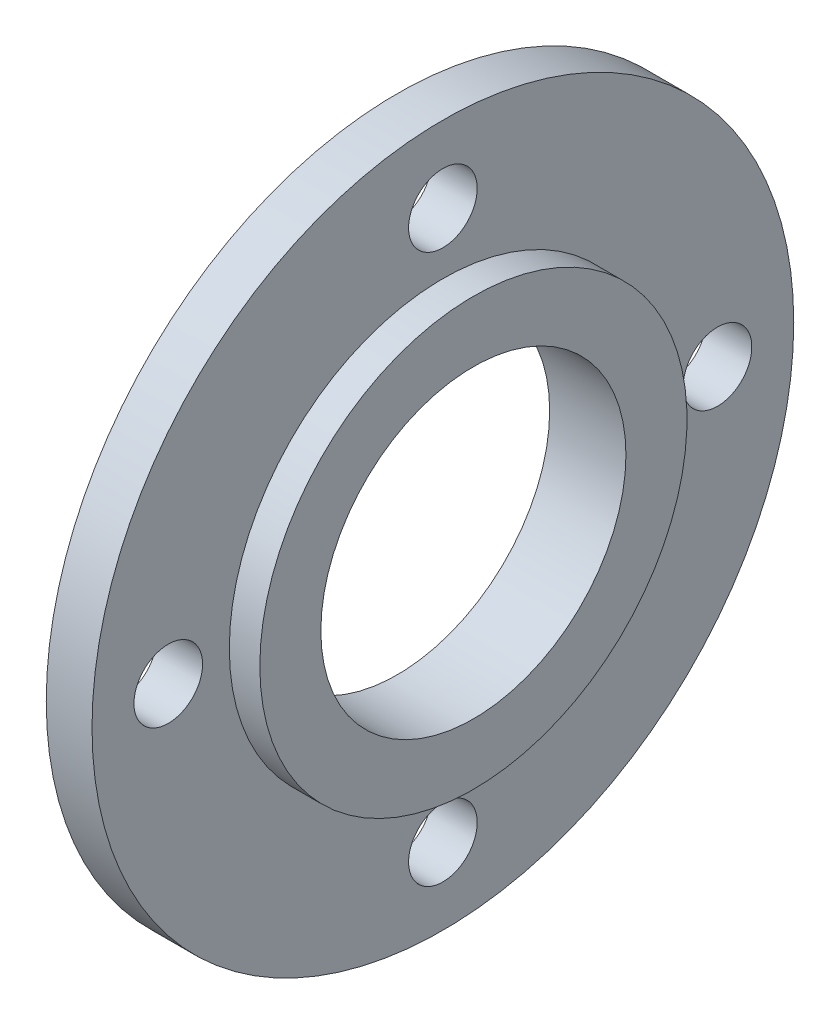
ISO-10303-21;
HEADER;
FILE_DESCRIPTION(('STEP AP214'),'2;1');
FILE_NAME('part.step','',(''),(''),'','','');
FILE_SCHEMA(('AUTOMOTIVE_DESIGN { 1 0 10303 214 1 1 1 1 }'));
ENDSEC;
DATA;
#1=APPLICATION_CONTEXT('core data for automotive mechanical design processes');
#2=APPLICATION_PROTOCOL_DEFINITION('international standard','automotive_design',2000,#1);
#3=PRODUCT_CONTEXT('',#1,'mechanical');
#4=PRODUCT('Part','Part','',(#3));
#5=PRODUCT_RELATED_PRODUCT_CATEGORY('part','',(#4));
#6=PRODUCT_DEFINITION_FORMATION('','',#4);
#7=PRODUCT_DEFINITION_CONTEXT('part definition',#1,'design');
#8=PRODUCT_DEFINITION('design','',#6,#7);
#9=PRODUCT_DEFINITION_SHAPE('','',#8);
#10=(LENGTH_UNIT() NAMED_UNIT(*) SI_UNIT(.MILLI.,.METRE.));
#11=(NAMED_UNIT(*) PLANE_ANGLE_UNIT() SI_UNIT($,.RADIAN.));
#12=(NAMED_UNIT(*) SI_UNIT($,.STERADIAN.) SOLID_ANGLE_UNIT());
#13=UNCERTAINTY_MEASURE_WITH_UNIT(LENGTH_MEASURE(1.E-05),#10,'distance_accuracy_value','');
#14=(GEOMETRIC_REPRESENTATION_CONTEXT(3) GLOBAL_UNCERTAINTY_ASSIGNED_CONTEXT((#13)) GLOBAL_UNIT_ASSIGNED_CONTEXT((#10,
#11,#12)) REPRESENTATION_CONTEXT('',''));
#15=CARTESIAN_POINT('',(0.,0.,0.));
#16=DIRECTION('',(0.,0.,1.));
#17=DIRECTION('',(1.,0.,0.));
#18=AXIS2_PLACEMENT_3D('',#15,#16,#17);
#19=CARTESIAN_POINT('',(0.,23.,0.));
#20=DIRECTION('',(1.,0.,0.));
#21=DIRECTION('',(0.,0.,-1.));
#22=AXIS2_PLACEMENT_3D('',#19,#20,#21);
#23=PLANE('',#22);
#24=CARTESIAN_POINT('',(0.,-18.,0.));
#25=DIRECTION('',(-1.,0.,0.));
#26=DIRECTION('',(0.,0.,1.));
#27=AXIS2_PLACEMENT_3D('',#24,#25,#26);
#28=CIRCLE('',#27,2.25);
#29=CARTESIAN_POINT('',(0.,-18.,2.25));
#30=VERTEX_POINT('',#29);
#31=EDGE_CURVE('E74',#30,#30,#28,.T.);
#32=ORIENTED_EDGE('',*,*,#31,.F.);
#33=EDGE_LOOP('',(#32));
#34=FACE_BOUND('',#33,.T.);
#35=CARTESIAN_POINT('',(0.,18.,0.));
#36=DIRECTION('',(-1.,0.,0.));
#37=DIRECTION('',(0.,0.,1.));
#38=AXIS2_PLACEMENT_3D('',#35,#36,#37);
#39=CIRCLE('',#38,2.25);
#40=CARTESIAN_POINT('',(0.,18.,2.25));
#41=VERTEX_POINT('',#40);
#42=EDGE_CURVE('E62',#41,#41,#39,.T.);
#43=ORIENTED_EDGE('',*,*,#42,.F.);
#44=EDGE_LOOP('',(#43));
#45=FACE_BOUND('',#44,.T.);
#46=CARTESIAN_POINT('',(0.,0.,0.));
#47=DIRECTION('',(-1.,0.,0.));
#48=DIRECTION('',(0.,0.,1.));
#49=AXIS2_PLACEMENT_3D('',#46,#47,#48);
#50=CIRCLE('',#49,10.);
#51=CARTESIAN_POINT('',(0.,0.,10.));
#52=VERTEX_POINT('',#51);
#53=EDGE_CURVE('E10',#52,#52,#50,.T.);
#54=ORIENTED_EDGE('',*,*,#53,.F.);
#55=EDGE_LOOP('',(#54));
#56=FACE_BOUND('',#55,.T.);
#57=CARTESIAN_POINT('',(0.,0.,0.));
#58=DIRECTION('',(-1.,0.,0.));
#59=DIRECTION('',(0.,0.,1.));
#60=AXIS2_PLACEMENT_3D('',#57,#58,#59);
#61=CIRCLE('',#60,23.);
#62=CARTESIAN_POINT('',(0.,0.,23.));
#63=VERTEX_POINT('',#62);
#64=EDGE_CURVE('E56',#63,#63,#61,.T.);
#65=ORIENTED_EDGE('',*,*,#64,.T.);
#66=EDGE_LOOP('',(#65));
#67=FACE_BOUND('',#66,.T.);
#68=CARTESIAN_POINT('',(0.,0.,-18.));
#69=DIRECTION('',(-1.,0.,0.));
#70=DIRECTION('',(0.,0.,1.));
#71=AXIS2_PLACEMENT_3D('',#68,#69,#70);
#72=CIRCLE('',#71,2.25);
#73=CARTESIAN_POINT('',(0.,0.,-15.75));
#74=VERTEX_POINT('',#73);
#75=EDGE_CURVE('E68',#74,#74,#72,.T.);
#76=ORIENTED_EDGE('',*,*,#75,.F.);
#77=EDGE_LOOP('',(#76));
#78=FACE_BOUND('',#77,.T.);
#79=CARTESIAN_POINT('',(0.,1.88539992297529E-13,18.));
#80=DIRECTION('',(-1.,0.,0.));
#81=DIRECTION('',(0.,0.,1.));
#82=AXIS2_PLACEMENT_3D('',#79,#80,#81);
#83=CIRCLE('',#82,2.25);
#84=CARTESIAN_POINT('',(0.,1.88539992297529E-13,20.25));
#85=VERTEX_POINT('',#84);
#86=EDGE_CURVE('E80',#85,#85,#83,.T.);
#87=ORIENTED_EDGE('',*,*,#86,.F.);
#88=EDGE_LOOP('',(#87));
#89=FACE_BOUND('',#88,.T.);
#90=ADVANCED_FACE('F34',(#34,#45,#56,#67,#78,#89),#23,.F.);
#91=CARTESIAN_POINT('',(0.,0.,0.));
#92=DIRECTION('',(-1.,0.,0.));
#93=DIRECTION('',(0.,0.,1.));
#94=AXIS2_PLACEMENT_3D('',#91,#92,#93);
#95=CYLINDRICAL_SURFACE('',#94,10.);
#96=CARTESIAN_POINT('',(5.,0.,0.));
#97=DIRECTION('',(-1.,0.,0.));
#98=DIRECTION('',(0.,0.,1.));
#99=AXIS2_PLACEMENT_3D('',#96,#97,#98);
#100=CIRCLE('',#99,10.);
#101=CARTESIAN_POINT('',(5.,0.,10.));
#102=VERTEX_POINT('',#101);
#103=EDGE_CURVE('E40',#102,#102,#100,.T.);
#104=ORIENTED_EDGE('',*,*,#103,.F.);
#105=EDGE_LOOP('',(#104));
#106=FACE_BOUND('',#105,.T.);
#107=ORIENTED_EDGE('',*,*,#53,.T.);
#108=EDGE_LOOP('',(#107));
#109=FACE_BOUND('',#108,.T.);
#110=ADVANCED_FACE('F87',(#106,#109),#95,.F.);
#111=CARTESIAN_POINT('',(5.,10.,0.));
#112=DIRECTION('',(-1.,0.,0.));
#113=DIRECTION('',(0.,0.,1.));
#114=AXIS2_PLACEMENT_3D('',#111,#112,#113);
#115=PLANE('',#114);
#116=CARTESIAN_POINT('',(5.,0.,0.));
#117=DIRECTION('',(-1.,0.,0.));
#118=DIRECTION('',(0.,0.,1.));
#119=AXIS2_PLACEMENT_3D('',#116,#117,#118);
#120=CIRCLE('',#119,14.);
#121=CARTESIAN_POINT('',(5.,0.,14.));
#122=VERTEX_POINT('',#121);
#123=EDGE_CURVE('E44',#122,#122,#120,.T.);
#124=ORIENTED_EDGE('',*,*,#123,.F.);
#125=EDGE_LOOP('',(#124));
#126=FACE_BOUND('',#125,.T.);
#127=ORIENTED_EDGE('',*,*,#103,.T.);
#128=EDGE_LOOP('',(#127));
#129=FACE_BOUND('',#128,.T.);
#130=ADVANCED_FACE('F92',(#126,#129),#115,.F.);
#131=CARTESIAN_POINT('',(0.,0.,0.));
#132=DIRECTION('',(-1.,0.,0.));
#133=DIRECTION('',(0.,0.,1.));
#134=AXIS2_PLACEMENT_3D('',#131,#132,#133);
#135=CYLINDRICAL_SURFACE('',#134,14.);
#136=CARTESIAN_POINT('',(3.,0.,0.));
#137=DIRECTION('',(-1.,0.,0.));
#138=DIRECTION('',(0.,0.,1.));
#139=AXIS2_PLACEMENT_3D('',#136,#137,#138);
#140=CIRCLE('',#139,14.);
#141=CARTESIAN_POINT('',(3.,0.,14.));
#142=VERTEX_POINT('',#141);
#143=EDGE_CURVE('E48',#142,#142,#140,.T.);
#144=ORIENTED_EDGE('',*,*,#143,.F.);
#145=EDGE_LOOP('',(#144));
#146=FACE_BOUND('',#145,.T.);
#147=ORIENTED_EDGE('',*,*,#123,.T.);
#148=EDGE_LOOP('',(#147));
#149=FACE_BOUND('',#148,.T.);
#150=ADVANCED_FACE('F127',(#146,#149),#135,.T.);
#151=CARTESIAN_POINT('',(3.,14.,0.));
#152=DIRECTION('',(-1.,0.,0.));
#153=DIRECTION('',(0.,0.,1.));
#154=AXIS2_PLACEMENT_3D('',#151,#152,#153);
#155=PLANE('',#154);
#156=CARTESIAN_POINT('',(3.,1.88539992297529E-13,18.));
#157=DIRECTION('',(-1.,0.,0.));
#158=DIRECTION('',(0.,0.,1.));
#159=AXIS2_PLACEMENT_3D('',#156,#157,#158);
#160=CIRCLE('',#159,2.25);
#161=CARTESIAN_POINT('',(3.,1.88539992297529E-13,20.25));
#162=VERTEX_POINT('',#161);
#163=EDGE_CURVE('E77',#162,#162,#160,.T.);
#164=ORIENTED_EDGE('',*,*,#163,.T.);
#165=EDGE_LOOP('',(#164));
#166=FACE_BOUND('',#165,.T.);
#167=CARTESIAN_POINT('',(3.,-18.,0.));
#168=DIRECTION('',(-1.,0.,0.));
#169=DIRECTION('',(0.,0.,1.));
#170=AXIS2_PLACEMENT_3D('',#167,#168,#169);
#171=CIRCLE('',#170,2.25);
#172=CARTESIAN_POINT('',(3.,-18.,2.25));
#173=VERTEX_POINT('',#172);
#174=EDGE_CURVE('E71',#173,#173,#171,.T.);
#175=ORIENTED_EDGE('',*,*,#174,.T.);
#176=EDGE_LOOP('',(#175));
#177=FACE_BOUND('',#176,.T.);
#178=CARTESIAN_POINT('',(3.,0.,-18.));
#179=DIRECTION('',(-1.,0.,0.));
#180=DIRECTION('',(0.,0.,1.));
#181=AXIS2_PLACEMENT_3D('',#178,#179,#180);
#182=CIRCLE('',#181,2.25);
#183=CARTESIAN_POINT('',(3.,0.,-15.75));
#184=VERTEX_POINT('',#183);
#185=EDGE_CURVE('E65',#184,#184,#182,.T.);
#186=ORIENTED_EDGE('',*,*,#185,.T.);
#187=EDGE_LOOP('',(#186));
#188=FACE_BOUND('',#187,.T.);
#189=CARTESIAN_POINT('',(3.,18.,0.));
#190=DIRECTION('',(-1.,0.,0.));
#191=DIRECTION('',(0.,0.,1.));
#192=AXIS2_PLACEMENT_3D('',#189,#190,#191);
#193=CIRCLE('',#192,2.25);
#194=CARTESIAN_POINT('',(3.,18.,2.25));
#195=VERTEX_POINT('',#194);
#196=EDGE_CURVE('E59',#195,#195,#193,.T.);
#197=ORIENTED_EDGE('',*,*,#196,.T.);
#198=EDGE_LOOP('',(#197));
#199=FACE_BOUND('',#198,.T.);
#200=CARTESIAN_POINT('',(3.,0.,0.));
#201=DIRECTION('',(-1.,0.,0.));
#202=DIRECTION('',(0.,0.,1.));
#203=AXIS2_PLACEMENT_3D('',#200,#201,#202);
#204=CIRCLE('',#203,23.);
#205=CARTESIAN_POINT('',(3.,0.,23.));
#206=VERTEX_POINT('',#205);
#207=EDGE_CURVE('E53',#206,#206,#204,.T.);
#208=ORIENTED_EDGE('',*,*,#207,.F.);
#209=EDGE_LOOP('',(#208));
#210=FACE_BOUND('',#209,.T.);
#211=ORIENTED_EDGE('',*,*,#143,.T.);
#212=EDGE_LOOP('',(#211));
#213=FACE_BOUND('',#212,.T.);
#214=ADVANCED_FACE('F123',(#166,#177,#188,#199,#210,#213),#155,.F.);
#215=CARTESIAN_POINT('',(0.,0.,0.));
#216=DIRECTION('',(-1.,0.,0.));
#217=DIRECTION('',(0.,0.,1.));
#218=AXIS2_PLACEMENT_3D('',#215,#216,#217);
#219=CYLINDRICAL_SURFACE('',#218,23.);
#220=ORIENTED_EDGE('',*,*,#64,.F.);
#221=EDGE_LOOP('',(#220));
#222=FACE_BOUND('',#221,.T.);
#223=ORIENTED_EDGE('',*,*,#207,.T.);
#224=EDGE_LOOP('',(#223));
#225=FACE_BOUND('',#224,.T.);
#226=ADVANCED_FACE('F115',(#222,#225),#219,.T.);
#227=CARTESIAN_POINT('',(0.,18.,0.));
#228=DIRECTION('',(-1.,0.,0.));
#229=DIRECTION('',(0.,0.,1.));
#230=AXIS2_PLACEMENT_3D('',#227,#228,#229);
#231=CYLINDRICAL_SURFACE('',#230,2.25);
#232=ORIENTED_EDGE('',*,*,#196,.F.);
#233=EDGE_LOOP('',(#232));
#234=FACE_BOUND('',#233,.T.);
#235=ORIENTED_EDGE('',*,*,#42,.T.);
#236=EDGE_LOOP('',(#235));
#237=FACE_BOUND('',#236,.T.);
#238=ADVANCED_FACE('F106',(#234,#237),#231,.F.);
#239=CARTESIAN_POINT('',(0.,0.,-18.));
#240=DIRECTION('',(-1.,0.,0.));
#241=DIRECTION('',(0.,0.,1.));
#242=AXIS2_PLACEMENT_3D('',#239,#240,#241);
#243=CYLINDRICAL_SURFACE('',#242,2.25);
#244=ORIENTED_EDGE('',*,*,#185,.F.);
#245=EDGE_LOOP('',(#244));
#246=FACE_BOUND('',#245,.T.);
#247=ORIENTED_EDGE('',*,*,#75,.T.);
#248=EDGE_LOOP('',(#247));
#249=FACE_BOUND('',#248,.T.);
#250=ADVANCED_FACE('F103',(#246,#249),#243,.F.);
#251=CARTESIAN_POINT('',(0.,-18.,0.));
#252=DIRECTION('',(-1.,0.,0.));
#253=DIRECTION('',(0.,0.,1.));
#254=AXIS2_PLACEMENT_3D('',#251,#252,#253);
#255=CYLINDRICAL_SURFACE('',#254,2.25);
#256=ORIENTED_EDGE('',*,*,#174,.F.);
#257=EDGE_LOOP('',(#256));
#258=FACE_BOUND('',#257,.T.);
#259=ORIENTED_EDGE('',*,*,#31,.T.);
#260=EDGE_LOOP('',(#259));
#261=FACE_BOUND('',#260,.T.);
#262=ADVANCED_FACE('F105',(#258,#261),#255,.F.);
#263=CARTESIAN_POINT('',(0.,1.88539992297529E-13,18.));
#264=DIRECTION('',(-1.,0.,0.));
#265=DIRECTION('',(0.,0.,1.));
#266=AXIS2_PLACEMENT_3D('',#263,#264,#265);
#267=CYLINDRICAL_SURFACE('',#266,2.25);
#268=ORIENTED_EDGE('',*,*,#163,.F.);
#269=EDGE_LOOP('',(#268));
#270=FACE_BOUND('',#269,.T.);
#271=ORIENTED_EDGE('',*,*,#86,.T.);
#272=EDGE_LOOP('',(#271));
#273=FACE_BOUND('',#272,.T.);
#274=ADVANCED_FACE('F84',(#270,#273),#267,.F.);
#275=CLOSED_SHELL('',(#90,#110,#130,#150,#214,#226,#238,#250,#262,#274));
#276=MANIFOLD_SOLID_BREP('B2',#275);
#277=ADVANCED_BREP_SHAPE_REPRESENTATION('',(#18,#276),#14);
#278=SHAPE_DEFINITION_REPRESENTATION(#9,#277);
ENDSEC;
END-ISO-10303-21;
